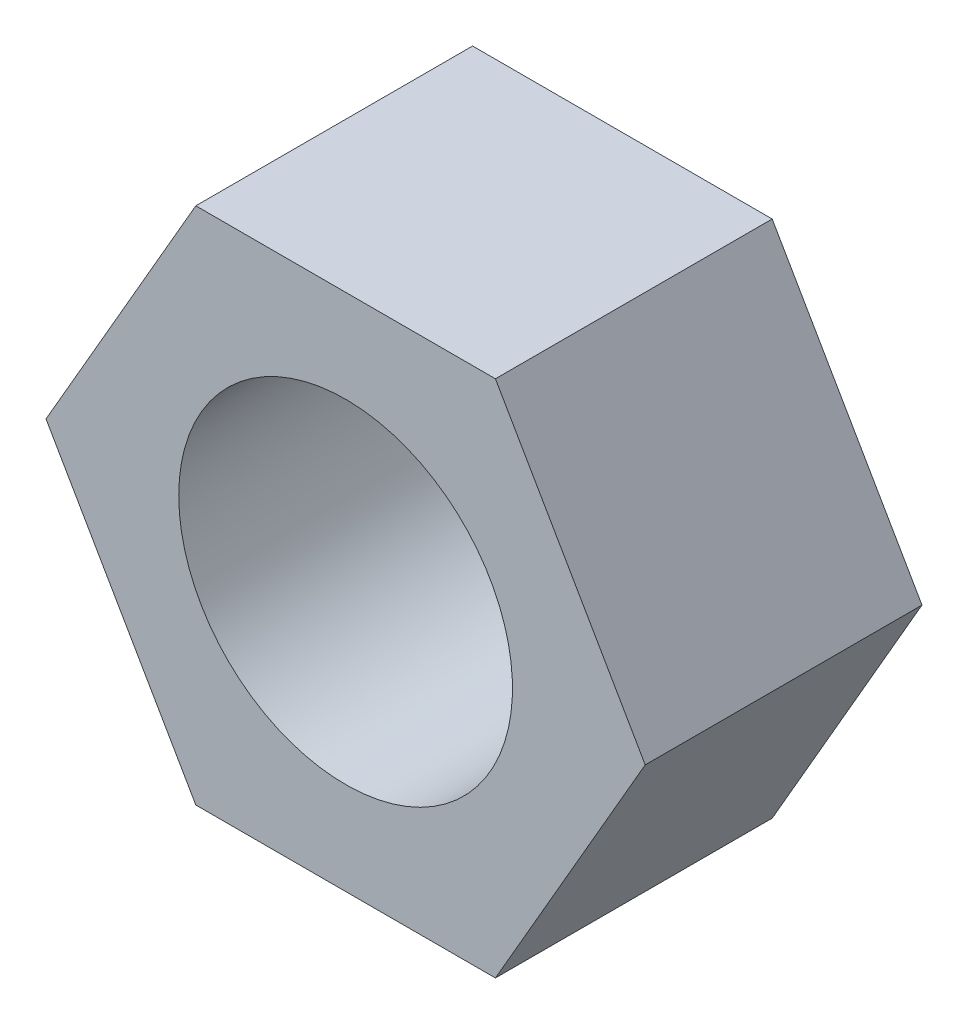
ISO-10303-21;
HEADER;
FILE_DESCRIPTION(('STEP AP214'),'2;1');
FILE_NAME('part.step','',(''),(''),'','','');
FILE_SCHEMA(('AUTOMOTIVE_DESIGN { 1 0 10303 214 1 1 1 1 }'));
ENDSEC;
DATA;
#1=APPLICATION_CONTEXT('core data for automotive mechanical design processes');
#2=APPLICATION_PROTOCOL_DEFINITION('international standard','automotive_design',2000,#1);
#3=PRODUCT_CONTEXT('',#1,'mechanical');
#4=PRODUCT('Part','Part','',(#3));
#5=PRODUCT_RELATED_PRODUCT_CATEGORY('part','',(#4));
#6=PRODUCT_DEFINITION_FORMATION('','',#4);
#7=PRODUCT_DEFINITION_CONTEXT('part definition',#1,'design');
#8=PRODUCT_DEFINITION('design','',#6,#7);
#9=PRODUCT_DEFINITION_SHAPE('','',#8);
#10=(LENGTH_UNIT() NAMED_UNIT(*) SI_UNIT(.MILLI.,.METRE.));
#11=(NAMED_UNIT(*) PLANE_ANGLE_UNIT() SI_UNIT($,.RADIAN.));
#12=(NAMED_UNIT(*) SI_UNIT($,.STERADIAN.) SOLID_ANGLE_UNIT());
#13=UNCERTAINTY_MEASURE_WITH_UNIT(LENGTH_MEASURE(1.E-05),#10,'distance_accuracy_value','');
#14=(GEOMETRIC_REPRESENTATION_CONTEXT(3) GLOBAL_UNCERTAINTY_ASSIGNED_CONTEXT((#13)) GLOBAL_UNIT_ASSIGNED_CONTEXT((#10,
#11,#12)) REPRESENTATION_CONTEXT('',''));
#15=CARTESIAN_POINT('',(0.,0.,0.));
#16=DIRECTION('',(0.,0.,1.));
#17=DIRECTION('',(1.,0.,0.));
#18=AXIS2_PLACEMENT_3D('',#15,#16,#17);
#19=CARTESIAN_POINT('',(-8.66025403784439,-15.,16.));
#20=DIRECTION('',(0.,1.,0.));
#21=DIRECTION('',(0.,0.,1.));
#22=AXIS2_PLACEMENT_3D('',#19,#20,#21);
#23=PLANE('',#22);
#24=DIRECTION('',(1.,0.,0.));
#25=VECTOR('',#24,1.);
#26=CARTESIAN_POINT('',(-8.66025403784439,-15.,0.));
#27=LINE('',#26,#25);
#28=CARTESIAN_POINT('',(-8.66025403784439,-15.,0.));
#29=VERTEX_POINT('',#28);
#30=CARTESIAN_POINT('',(8.66025403784438,-15.,0.));
#31=VERTEX_POINT('',#30);
#32=EDGE_CURVE('E117',#29,#31,#27,.T.);
#33=ORIENTED_EDGE('',*,*,#32,.T.);
#34=DIRECTION('',(0.,0.,-1.));
#35=VECTOR('',#34,1.);
#36=CARTESIAN_POINT('',(8.66025403784438,-15.,16.));
#37=LINE('',#36,#35);
#38=CARTESIAN_POINT('',(8.66025403784438,-15.,16.));
#39=VERTEX_POINT('',#38);
#40=EDGE_CURVE('E11',#39,#31,#37,.T.);
#41=ORIENTED_EDGE('',*,*,#40,.F.);
#42=DIRECTION('',(1.,0.,0.));
#43=VECTOR('',#42,1.);
#44=CARTESIAN_POINT('',(-8.66025403784439,-15.,16.));
#45=LINE('',#44,#43);
#46=CARTESIAN_POINT('',(-8.66025403784439,-15.,16.));
#47=VERTEX_POINT('',#46);
#48=EDGE_CURVE('E128',#47,#39,#45,.T.);
#49=ORIENTED_EDGE('',*,*,#48,.F.);
#50=DIRECTION('',(0.,0.,-1.));
#51=VECTOR('',#50,1.);
#52=CARTESIAN_POINT('',(-8.66025403784439,-15.,16.));
#53=LINE('',#52,#51);
#54=EDGE_CURVE('E113',#47,#29,#53,.T.);
#55=ORIENTED_EDGE('',*,*,#54,.T.);
#56=EDGE_LOOP('',(#33,#41,#49,#55));
#57=FACE_BOUND('',#56,.T.);
#58=ADVANCED_FACE('F33',(#57),#23,.F.);
#59=CARTESIAN_POINT('',(8.66025403784438,-15.,16.));
#60=DIRECTION('',(-0.866025403784439,0.5,0.));
#61=DIRECTION('',(-0.5,-0.866025403784439,0.));
#62=AXIS2_PLACEMENT_3D('',#59,#60,#61);
#63=PLANE('',#62);
#64=DIRECTION('',(0.5,0.866025403784439,0.));
#65=VECTOR('',#64,1.);
#66=CARTESIAN_POINT('',(8.66025403784438,-15.,0.));
#67=LINE('',#66,#65);
#68=CARTESIAN_POINT('',(17.3205080756888,0.,0.));
#69=VERTEX_POINT('',#68);
#70=EDGE_CURVE('E120',#31,#69,#67,.T.);
#71=ORIENTED_EDGE('',*,*,#70,.T.);
#72=DIRECTION('',(0.,0.,-1.));
#73=VECTOR('',#72,1.);
#74=CARTESIAN_POINT('',(17.3205080756888,0.,16.));
#75=LINE('',#74,#73);
#76=CARTESIAN_POINT('',(17.3205080756888,0.,16.));
#77=VERTEX_POINT('',#76);
#78=EDGE_CURVE('E41',#77,#69,#75,.T.);
#79=ORIENTED_EDGE('',*,*,#78,.F.);
#80=DIRECTION('',(0.5,0.866025403784439,0.));
#81=VECTOR('',#80,1.);
#82=CARTESIAN_POINT('',(8.66025403784438,-15.,16.));
#83=LINE('',#82,#81);
#84=EDGE_CURVE('E86',#39,#77,#83,.T.);
#85=ORIENTED_EDGE('',*,*,#84,.F.);
#86=ORIENTED_EDGE('',*,*,#40,.T.);
#87=EDGE_LOOP('',(#71,#79,#85,#86));
#88=FACE_BOUND('',#87,.T.);
#89=ADVANCED_FACE('F153',(#88),#63,.F.);
#90=CARTESIAN_POINT('',(17.3205080756888,0.,16.));
#91=DIRECTION('',(-0.866025403784439,-0.5,0.));
#92=DIRECTION('',(0.5,-0.866025403784439,0.));
#93=AXIS2_PLACEMENT_3D('',#90,#91,#92);
#94=PLANE('',#93);
#95=DIRECTION('',(-0.5,0.866025403784439,0.));
#96=VECTOR('',#95,1.);
#97=CARTESIAN_POINT('',(17.3205080756888,0.,0.));
#98=LINE('',#97,#96);
#99=CARTESIAN_POINT('',(8.66025403784439,15.,0.));
#100=VERTEX_POINT('',#99);
#101=EDGE_CURVE('E123',#69,#100,#98,.T.);
#102=ORIENTED_EDGE('',*,*,#101,.T.);
#103=DIRECTION('',(0.,0.,-1.));
#104=VECTOR('',#103,1.);
#105=CARTESIAN_POINT('',(8.66025403784439,15.,16.));
#106=LINE('',#105,#104);
#107=CARTESIAN_POINT('',(8.66025403784439,15.,16.));
#108=VERTEX_POINT('',#107);
#109=EDGE_CURVE('E108',#108,#100,#106,.T.);
#110=ORIENTED_EDGE('',*,*,#109,.F.);
#111=DIRECTION('',(-0.5,0.866025403784439,0.));
#112=VECTOR('',#111,1.);
#113=CARTESIAN_POINT('',(17.3205080756888,0.,16.));
#114=LINE('',#113,#112);
#115=EDGE_CURVE('E99',#77,#108,#114,.T.);
#116=ORIENTED_EDGE('',*,*,#115,.F.);
#117=ORIENTED_EDGE('',*,*,#78,.T.);
#118=EDGE_LOOP('',(#102,#110,#116,#117));
#119=FACE_BOUND('',#118,.T.);
#120=ADVANCED_FACE('F134',(#119),#94,.F.);
#121=CARTESIAN_POINT('',(8.66025403784439,15.,16.));
#122=DIRECTION('',(0.,-1.,0.));
#123=DIRECTION('',(1.,0.,0.));
#124=AXIS2_PLACEMENT_3D('',#121,#122,#123);
#125=PLANE('',#124);
#126=DIRECTION('',(-1.,0.,0.));
#127=VECTOR('',#126,1.);
#128=CARTESIAN_POINT('',(8.66025403784439,15.,0.));
#129=LINE('',#128,#127);
#130=CARTESIAN_POINT('',(-8.66025403784438,15.,0.));
#131=VERTEX_POINT('',#130);
#132=EDGE_CURVE('E107',#100,#131,#129,.T.);
#133=ORIENTED_EDGE('',*,*,#132,.T.);
#134=DIRECTION('',(0.,0.,-1.));
#135=VECTOR('',#134,1.);
#136=CARTESIAN_POINT('',(-8.66025403784438,15.,16.));
#137=LINE('',#136,#135);
#138=CARTESIAN_POINT('',(-8.66025403784438,15.,16.));
#139=VERTEX_POINT('',#138);
#140=EDGE_CURVE('E104',#139,#131,#137,.T.);
#141=ORIENTED_EDGE('',*,*,#140,.F.);
#142=DIRECTION('',(-1.,0.,0.));
#143=VECTOR('',#142,1.);
#144=CARTESIAN_POINT('',(8.66025403784439,15.,16.));
#145=LINE('',#144,#143);
#146=EDGE_CURVE('E93',#108,#139,#145,.T.);
#147=ORIENTED_EDGE('',*,*,#146,.F.);
#148=ORIENTED_EDGE('',*,*,#109,.T.);
#149=EDGE_LOOP('',(#133,#141,#147,#148));
#150=FACE_BOUND('',#149,.T.);
#151=ADVANCED_FACE('F105',(#150),#125,.F.);
#152=CARTESIAN_POINT('',(-8.66025403784438,15.,16.));
#153=DIRECTION('',(0.866025403784439,-0.5,0.));
#154=DIRECTION('',(0.5,0.866025403784439,0.));
#155=AXIS2_PLACEMENT_3D('',#152,#153,#154);
#156=PLANE('',#155);
#157=DIRECTION('',(-0.5,-0.866025403784439,0.));
#158=VECTOR('',#157,1.);
#159=CARTESIAN_POINT('',(-8.66025403784438,15.,0.));
#160=LINE('',#159,#158);
#161=CARTESIAN_POINT('',(-17.3205080756888,0.,0.));
#162=VERTEX_POINT('',#161);
#163=EDGE_CURVE('E72',#131,#162,#160,.T.);
#164=ORIENTED_EDGE('',*,*,#163,.T.);
#165=DIRECTION('',(0.,0.,-1.));
#166=VECTOR('',#165,1.);
#167=CARTESIAN_POINT('',(-17.3205080756888,0.,16.));
#168=LINE('',#167,#166);
#169=CARTESIAN_POINT('',(-17.3205080756888,0.,16.));
#170=VERTEX_POINT('',#169);
#171=EDGE_CURVE('E109',#170,#162,#168,.T.);
#172=ORIENTED_EDGE('',*,*,#171,.F.);
#173=DIRECTION('',(-0.5,-0.866025403784439,0.));
#174=VECTOR('',#173,1.);
#175=CARTESIAN_POINT('',(-8.66025403784438,15.,16.));
#176=LINE('',#175,#174);
#177=EDGE_CURVE('E97',#139,#170,#176,.T.);
#178=ORIENTED_EDGE('',*,*,#177,.F.);
#179=ORIENTED_EDGE('',*,*,#140,.T.);
#180=EDGE_LOOP('',(#164,#172,#178,#179));
#181=FACE_BOUND('',#180,.T.);
#182=ADVANCED_FACE('F111',(#181),#156,.F.);
#183=CARTESIAN_POINT('',(-17.3205080756888,0.,16.));
#184=DIRECTION('',(0.866025403784439,0.5,0.));
#185=DIRECTION('',(-0.5,0.866025403784439,0.));
#186=AXIS2_PLACEMENT_3D('',#183,#184,#185);
#187=PLANE('',#186);
#188=DIRECTION('',(0.5,-0.866025403784439,0.));
#189=VECTOR('',#188,1.);
#190=CARTESIAN_POINT('',(-17.3205080756888,0.,0.));
#191=LINE('',#190,#189);
#192=EDGE_CURVE('E78',#162,#29,#191,.T.);
#193=ORIENTED_EDGE('',*,*,#192,.T.);
#194=ORIENTED_EDGE('',*,*,#54,.F.);
#195=DIRECTION('',(0.5,-0.866025403784439,0.));
#196=VECTOR('',#195,1.);
#197=CARTESIAN_POINT('',(-17.3205080756888,0.,16.));
#198=LINE('',#197,#196);
#199=EDGE_CURVE('E49',#170,#47,#198,.T.);
#200=ORIENTED_EDGE('',*,*,#199,.F.);
#201=ORIENTED_EDGE('',*,*,#171,.T.);
#202=EDGE_LOOP('',(#193,#194,#200,#201));
#203=FACE_BOUND('',#202,.T.);
#204=ADVANCED_FACE('F141',(#203),#187,.F.);
#205=CARTESIAN_POINT('',(0.,0.,16.));
#206=DIRECTION('',(0.,0.,1.));
#207=DIRECTION('',(1.,0.,0.));
#208=AXIS2_PLACEMENT_3D('',#205,#206,#207);
#209=PLANE('',#208);
#210=CARTESIAN_POINT('',(0.,0.,16.));
#211=DIRECTION('',(0.,0.,-1.));
#212=DIRECTION('',(-1.,0.,0.));
#213=AXIS2_PLACEMENT_3D('',#210,#211,#212);
#214=CIRCLE('',#213,9.647);
#215=CARTESIAN_POINT('',(-9.647,0.,16.));
#216=VERTEX_POINT('',#215);
#217=EDGE_CURVE('E121',#216,#216,#214,.T.);
#218=ORIENTED_EDGE('',*,*,#217,.T.);
#219=EDGE_LOOP('',(#218));
#220=FACE_BOUND('',#219,.T.);
#221=ORIENTED_EDGE('',*,*,#48,.T.);
#222=ORIENTED_EDGE('',*,*,#84,.T.);
#223=ORIENTED_EDGE('',*,*,#115,.T.);
#224=ORIENTED_EDGE('',*,*,#146,.T.);
#225=ORIENTED_EDGE('',*,*,#177,.T.);
#226=ORIENTED_EDGE('',*,*,#199,.T.);
#227=EDGE_LOOP('',(#221,#222,#223,#224,#225,#226));
#228=FACE_BOUND('',#227,.T.);
#229=ADVANCED_FACE('F95',(#220,#228),#209,.T.);
#230=CARTESIAN_POINT('',(0.,0.,0.));
#231=DIRECTION('',(0.,0.,1.));
#232=DIRECTION('',(1.,0.,0.));
#233=AXIS2_PLACEMENT_3D('',#230,#231,#232);
#234=PLANE('',#233);
#235=CARTESIAN_POINT('',(0.,0.,0.));
#236=DIRECTION('',(0.,0.,-1.));
#237=DIRECTION('',(-1.,0.,0.));
#238=AXIS2_PLACEMENT_3D('',#235,#236,#237);
#239=CIRCLE('',#238,9.647);
#240=CARTESIAN_POINT('',(-9.647,0.,0.));
#241=VERTEX_POINT('',#240);
#242=EDGE_CURVE('E208',#241,#241,#239,.T.);
#243=ORIENTED_EDGE('',*,*,#242,.F.);
#244=EDGE_LOOP('',(#243));
#245=FACE_BOUND('',#244,.T.);
#246=ORIENTED_EDGE('',*,*,#32,.F.);
#247=ORIENTED_EDGE('',*,*,#192,.F.);
#248=ORIENTED_EDGE('',*,*,#163,.F.);
#249=ORIENTED_EDGE('',*,*,#132,.F.);
#250=ORIENTED_EDGE('',*,*,#101,.F.);
#251=ORIENTED_EDGE('',*,*,#70,.F.);
#252=EDGE_LOOP('',(#246,#247,#248,#249,#250,#251));
#253=FACE_BOUND('',#252,.T.);
#254=ADVANCED_FACE('F137',(#245,#253),#234,.F.);
#255=CARTESIAN_POINT('',(0.,0.,16.));
#256=DIRECTION('',(0.,0.,-1.));
#257=DIRECTION('',(-1.,0.,0.));
#258=AXIS2_PLACEMENT_3D('',#255,#256,#257);
#259=CYLINDRICAL_SURFACE('',#258,9.647);
#260=ORIENTED_EDGE('',*,*,#217,.F.);
#261=EDGE_LOOP('',(#260));
#262=FACE_BOUND('',#261,.T.);
#263=ORIENTED_EDGE('',*,*,#242,.T.);
#264=EDGE_LOOP('',(#263));
#265=FACE_BOUND('',#264,.T.);
#266=ADVANCED_FACE('F190',(#262,#265),#259,.F.);
#267=CLOSED_SHELL('',(#58,#89,#120,#151,#182,#204,#229,#254,#266));
#268=MANIFOLD_SOLID_BREP('B2',#267);
#269=ADVANCED_BREP_SHAPE_REPRESENTATION('',(#18,#268),#14);
#270=SHAPE_DEFINITION_REPRESENTATION(#9,#269);
ENDSEC;
END-ISO-10303-21;
